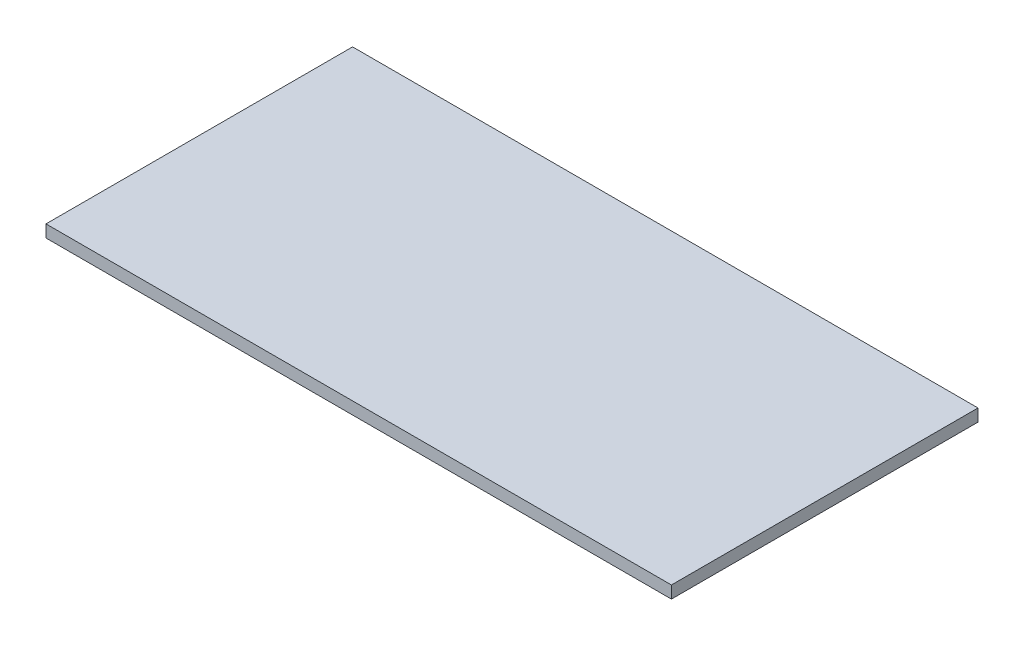
ISO-10303-21;
HEADER;
FILE_DESCRIPTION(('STEP AP214'),'2;1');
FILE_NAME('part.step','',(''),(''),'','','');
FILE_SCHEMA(('AUTOMOTIVE_DESIGN { 1 0 10303 214 1 1 1 1 }'));
ENDSEC;
DATA;
#1=APPLICATION_CONTEXT('core data for automotive mechanical design processes');
#2=APPLICATION_PROTOCOL_DEFINITION('international standard','automotive_design',2000,#1);
#3=PRODUCT_CONTEXT('',#1,'mechanical');
#4=PRODUCT('Part','Part','',(#3));
#5=PRODUCT_RELATED_PRODUCT_CATEGORY('part','',(#4));
#6=PRODUCT_DEFINITION_FORMATION('','',#4);
#7=PRODUCT_DEFINITION_CONTEXT('part definition',#1,'design');
#8=PRODUCT_DEFINITION('design','',#6,#7);
#9=PRODUCT_DEFINITION_SHAPE('','',#8);
#10=(LENGTH_UNIT() NAMED_UNIT(*) SI_UNIT(.MILLI.,.METRE.));
#11=(NAMED_UNIT(*) PLANE_ANGLE_UNIT() SI_UNIT($,.RADIAN.));
#12=(NAMED_UNIT(*) SI_UNIT($,.STERADIAN.) SOLID_ANGLE_UNIT());
#13=UNCERTAINTY_MEASURE_WITH_UNIT(LENGTH_MEASURE(1.E-05),#10,'distance_accuracy_value','');
#14=(GEOMETRIC_REPRESENTATION_CONTEXT(3) GLOBAL_UNCERTAINTY_ASSIGNED_CONTEXT((#13)) GLOBAL_UNIT_ASSIGNED_CONTEXT((#10,
#11,#12)) REPRESENTATION_CONTEXT('',''));
#15=CARTESIAN_POINT('',(0.,0.,0.));
#16=DIRECTION('',(0.,0.,1.));
#17=DIRECTION('',(1.,0.,0.));
#18=AXIS2_PLACEMENT_3D('',#15,#16,#17);
#19=CARTESIAN_POINT('',(-362.455752212389,12.7,-157.813421828909));
#20=DIRECTION('',(1.,0.,0.));
#21=DIRECTION('',(0.,0.,-1.));
#22=AXIS2_PLACEMENT_3D('',#19,#20,#21);
#23=PLANE('',#22);
#24=DIRECTION('',(0.,0.,1.));
#25=VECTOR('',#24,1.);
#26=CARTESIAN_POINT('',(-362.455752212389,0.,-157.813421828909));
#27=LINE('',#26,#25);
#28=CARTESIAN_POINT('',(-362.455752212389,0.,-157.813421828909));
#29=VERTEX_POINT('',#28);
#30=CARTESIAN_POINT('',(-362.455752212389,0.,159.686578171091));
#31=VERTEX_POINT('',#30);
#32=EDGE_CURVE('E100',#29,#31,#27,.T.);
#33=ORIENTED_EDGE('',*,*,#32,.T.);
#34=DIRECTION('',(0.,-1.,0.));
#35=VECTOR('',#34,1.);
#36=CARTESIAN_POINT('',(-362.455752212389,12.7,159.686578171091));
#37=LINE('',#36,#35);
#38=CARTESIAN_POINT('',(-362.455752212389,12.7,159.686578171091));
#39=VERTEX_POINT('',#38);
#40=EDGE_CURVE('E11',#39,#31,#37,.T.);
#41=ORIENTED_EDGE('',*,*,#40,.F.);
#42=DIRECTION('',(0.,0.,1.));
#43=VECTOR('',#42,1.);
#44=CARTESIAN_POINT('',(-362.455752212389,12.7,-157.813421828909));
#45=LINE('',#44,#43);
#46=CARTESIAN_POINT('',(-362.455752212389,12.7,-157.813421828909));
#47=VERTEX_POINT('',#46);
#48=EDGE_CURVE('E88',#47,#39,#45,.T.);
#49=ORIENTED_EDGE('',*,*,#48,.F.);
#50=DIRECTION('',(0.,-1.,0.));
#51=VECTOR('',#50,1.);
#52=CARTESIAN_POINT('',(-362.455752212389,12.7,-157.813421828909));
#53=LINE('',#52,#51);
#54=EDGE_CURVE('E96',#47,#29,#53,.T.);
#55=ORIENTED_EDGE('',*,*,#54,.T.);
#56=EDGE_LOOP('',(#33,#41,#49,#55));
#57=FACE_BOUND('',#56,.T.);
#58=ADVANCED_FACE('F37',(#57),#23,.F.);
#59=CARTESIAN_POINT('',(-362.455752212389,12.7,159.686578171091));
#60=DIRECTION('',(0.,0.,-1.));
#61=DIRECTION('',(-1.,0.,0.));
#62=AXIS2_PLACEMENT_3D('',#59,#60,#61);
#63=PLANE('',#62);
#64=DIRECTION('',(1.,0.,0.));
#65=VECTOR('',#64,1.);
#66=CARTESIAN_POINT('',(-362.455752212389,0.,159.686578171091));
#67=LINE('',#66,#65);
#68=CARTESIAN_POINT('',(285.244247787611,0.,159.686578171091));
#69=VERTEX_POINT('',#68);
#70=EDGE_CURVE('E92',#31,#69,#67,.T.);
#71=ORIENTED_EDGE('',*,*,#70,.T.);
#72=DIRECTION('',(0.,-1.,0.));
#73=VECTOR('',#72,1.);
#74=CARTESIAN_POINT('',(285.244247787611,12.7,159.686578171091));
#75=LINE('',#74,#73);
#76=CARTESIAN_POINT('',(285.244247787611,12.7,159.686578171091));
#77=VERTEX_POINT('',#76);
#78=EDGE_CURVE('E45',#77,#69,#75,.T.);
#79=ORIENTED_EDGE('',*,*,#78,.F.);
#80=DIRECTION('',(1.,0.,0.));
#81=VECTOR('',#80,1.);
#82=CARTESIAN_POINT('',(-362.455752212389,12.7,159.686578171091));
#83=LINE('',#82,#81);
#84=EDGE_CURVE('E83',#39,#77,#83,.T.);
#85=ORIENTED_EDGE('',*,*,#84,.F.);
#86=ORIENTED_EDGE('',*,*,#40,.T.);
#87=EDGE_LOOP('',(#71,#79,#85,#86));
#88=FACE_BOUND('',#87,.T.);
#89=ADVANCED_FACE('F91',(#88),#63,.F.);
#90=CARTESIAN_POINT('',(285.244247787611,12.7,-157.813421828909));
#91=DIRECTION('',(-1.,0.,0.));
#92=DIRECTION('',(0.,0.,1.));
#93=AXIS2_PLACEMENT_3D('',#90,#91,#92);
#94=PLANE('',#93);
#95=DIRECTION('',(0.,0.,-1.));
#96=VECTOR('',#95,1.);
#97=CARTESIAN_POINT('',(285.244247787611,0.,-157.813421828909));
#98=LINE('',#97,#96);
#99=CARTESIAN_POINT('',(285.244247787611,0.,-157.813421828909));
#100=VERTEX_POINT('',#99);
#101=EDGE_CURVE('E70',#69,#100,#98,.T.);
#102=ORIENTED_EDGE('',*,*,#101,.T.);
#103=DIRECTION('',(0.,-1.,0.));
#104=VECTOR('',#103,1.);
#105=CARTESIAN_POINT('',(285.244247787611,12.7,-157.813421828909));
#106=LINE('',#105,#104);
#107=CARTESIAN_POINT('',(285.244247787611,12.7,-157.813421828909));
#108=VERTEX_POINT('',#107);
#109=EDGE_CURVE('E93',#108,#100,#106,.T.);
#110=ORIENTED_EDGE('',*,*,#109,.F.);
#111=DIRECTION('',(0.,0.,-1.));
#112=VECTOR('',#111,1.);
#113=CARTESIAN_POINT('',(285.244247787611,12.7,-157.813421828909));
#114=LINE('',#113,#112);
#115=EDGE_CURVE('E86',#77,#108,#114,.T.);
#116=ORIENTED_EDGE('',*,*,#115,.F.);
#117=ORIENTED_EDGE('',*,*,#78,.T.);
#118=EDGE_LOOP('',(#102,#110,#116,#117));
#119=FACE_BOUND('',#118,.T.);
#120=ADVANCED_FACE('F94',(#119),#94,.F.);
#121=CARTESIAN_POINT('',(-362.455752212389,12.7,-157.813421828909));
#122=DIRECTION('',(0.,0.,1.));
#123=DIRECTION('',(1.,0.,0.));
#124=AXIS2_PLACEMENT_3D('',#121,#122,#123);
#125=PLANE('',#124);
#126=DIRECTION('',(-1.,0.,0.));
#127=VECTOR('',#126,1.);
#128=CARTESIAN_POINT('',(-362.455752212389,0.,-157.813421828909));
#129=LINE('',#128,#127);
#130=EDGE_CURVE('E76',#100,#29,#129,.T.);
#131=ORIENTED_EDGE('',*,*,#130,.T.);
#132=ORIENTED_EDGE('',*,*,#54,.F.);
#133=DIRECTION('',(-1.,0.,0.));
#134=VECTOR('',#133,1.);
#135=CARTESIAN_POINT('',(-362.455752212389,12.7,-157.813421828909));
#136=LINE('',#135,#134);
#137=EDGE_CURVE('E53',#108,#47,#136,.T.);
#138=ORIENTED_EDGE('',*,*,#137,.F.);
#139=ORIENTED_EDGE('',*,*,#109,.T.);
#140=EDGE_LOOP('',(#131,#132,#138,#139));
#141=FACE_BOUND('',#140,.T.);
#142=ADVANCED_FACE('F107',(#141),#125,.F.);
#143=CARTESIAN_POINT('',(0.,12.7,0.));
#144=DIRECTION('',(0.,1.,0.));
#145=DIRECTION('',(0.,0.,1.));
#146=AXIS2_PLACEMENT_3D('',#143,#144,#145);
#147=PLANE('',#146);
#148=ORIENTED_EDGE('',*,*,#48,.T.);
#149=ORIENTED_EDGE('',*,*,#84,.T.);
#150=ORIENTED_EDGE('',*,*,#115,.T.);
#151=ORIENTED_EDGE('',*,*,#137,.T.);
#152=EDGE_LOOP('',(#148,#149,#150,#151));
#153=FACE_BOUND('',#152,.T.);
#154=ADVANCED_FACE('F84',(#153),#147,.T.);
#155=CARTESIAN_POINT('',(0.,0.,0.));
#156=DIRECTION('',(0.,1.,0.));
#157=DIRECTION('',(0.,0.,1.));
#158=AXIS2_PLACEMENT_3D('',#155,#156,#157);
#159=PLANE('',#158);
#160=ORIENTED_EDGE('',*,*,#32,.F.);
#161=ORIENTED_EDGE('',*,*,#130,.F.);
#162=ORIENTED_EDGE('',*,*,#101,.F.);
#163=ORIENTED_EDGE('',*,*,#70,.F.);
#164=EDGE_LOOP('',(#160,#161,#162,#163));
#165=FACE_BOUND('',#164,.T.);
#166=ADVANCED_FACE('F110',(#165),#159,.F.);
#167=CLOSED_SHELL('',(#58,#89,#120,#142,#154,#166));
#168=MANIFOLD_SOLID_BREP('B2',#167);
#169=ADVANCED_BREP_SHAPE_REPRESENTATION('',(#18,#168),#14);
#170=SHAPE_DEFINITION_REPRESENTATION(#9,#169);
ENDSEC;
END-ISO-10303-21;
